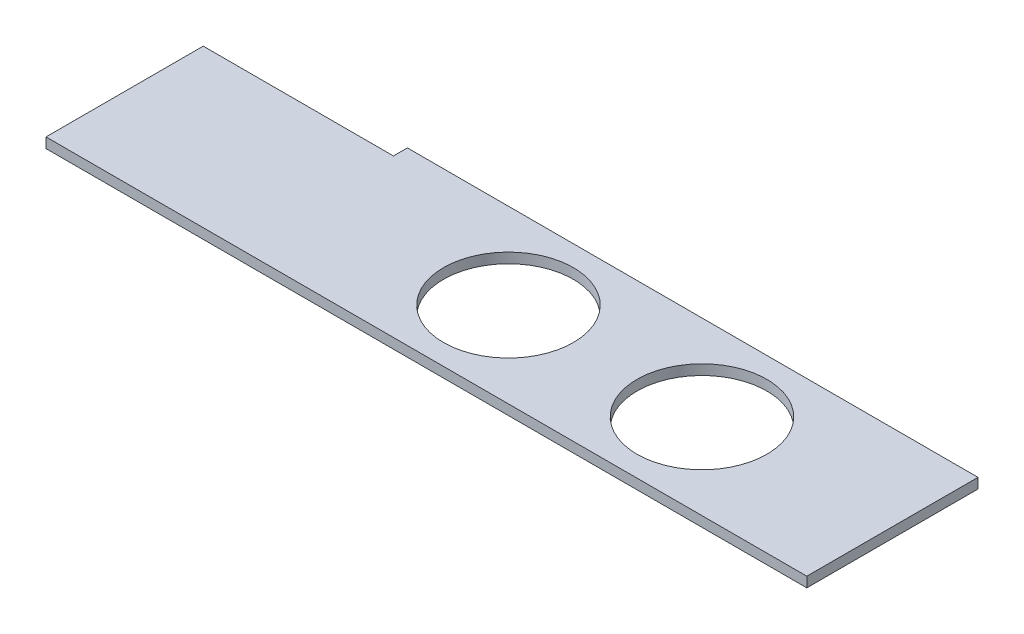
ISO-10303-21;
HEADER;
FILE_DESCRIPTION(('STEP AP214'),'2;1');
FILE_NAME('part.step','',(''),(''),'','','');
FILE_SCHEMA(('AUTOMOTIVE_DESIGN { 1 0 10303 214 1 1 1 1 }'));
ENDSEC;
DATA;
#1=APPLICATION_CONTEXT('core data for automotive mechanical design processes');
#2=APPLICATION_PROTOCOL_DEFINITION('international standard','automotive_design',2000,#1);
#3=PRODUCT_CONTEXT('',#1,'mechanical');
#4=PRODUCT('Part','Part','',(#3));
#5=PRODUCT_RELATED_PRODUCT_CATEGORY('part','',(#4));
#6=PRODUCT_DEFINITION_FORMATION('','',#4);
#7=PRODUCT_DEFINITION_CONTEXT('part definition',#1,'design');
#8=PRODUCT_DEFINITION('design','',#6,#7);
#9=PRODUCT_DEFINITION_SHAPE('','',#8);
#10=(LENGTH_UNIT() NAMED_UNIT(*) SI_UNIT(.MILLI.,.METRE.));
#11=(NAMED_UNIT(*) PLANE_ANGLE_UNIT() SI_UNIT($,.RADIAN.));
#12=(NAMED_UNIT(*) SI_UNIT($,.STERADIAN.) SOLID_ANGLE_UNIT());
#13=UNCERTAINTY_MEASURE_WITH_UNIT(LENGTH_MEASURE(1.E-05),#10,'distance_accuracy_value','');
#14=(GEOMETRIC_REPRESENTATION_CONTEXT(3) GLOBAL_UNCERTAINTY_ASSIGNED_CONTEXT((#13)) GLOBAL_UNIT_ASSIGNED_CONTEXT((#10,
#11,#12)) REPRESENTATION_CONTEXT('',''));
#15=CARTESIAN_POINT('',(0.,0.,0.));
#16=DIRECTION('',(0.,0.,1.));
#17=DIRECTION('',(1.,0.,0.));
#18=AXIS2_PLACEMENT_3D('',#15,#16,#17);
#19=CARTESIAN_POINT('',(0.,8.,0.));
#20=DIRECTION('',(-1.,0.,0.));
#21=DIRECTION('',(0.,0.,1.));
#22=AXIS2_PLACEMENT_3D('',#19,#20,#21);
#23=PLANE('',#22);
#24=DIRECTION('',(0.,1.,0.));
#25=VECTOR('',#24,1.);
#26=CARTESIAN_POINT('',(0.,0.,-124.));
#27=LINE('',#26,#25);
#28=CARTESIAN_POINT('',(0.,0.,-124.));
#29=VERTEX_POINT('',#28);
#30=CARTESIAN_POINT('',(0.,8.,-124.));
#31=VERTEX_POINT('',#30);
#32=EDGE_CURVE('E110',#29,#31,#27,.T.);
#33=ORIENTED_EDGE('',*,*,#32,.F.);
#34=DIRECTION('',(0.,0.,-1.));
#35=VECTOR('',#34,1.);
#36=CARTESIAN_POINT('',(0.,0.,0.));
#37=LINE('',#36,#35);
#38=CARTESIAN_POINT('',(0.,0.,0.));
#39=VERTEX_POINT('',#38);
#40=EDGE_CURVE('E118',#39,#29,#37,.T.);
#41=ORIENTED_EDGE('',*,*,#40,.F.);
#42=DIRECTION('',(0.,-1.,0.));
#43=VECTOR('',#42,1.);
#44=CARTESIAN_POINT('',(0.,8.,0.));
#45=LINE('',#44,#43);
#46=CARTESIAN_POINT('',(0.,8.,0.));
#47=VERTEX_POINT('',#46);
#48=EDGE_CURVE('E11',#47,#39,#45,.T.);
#49=ORIENTED_EDGE('',*,*,#48,.F.);
#50=DIRECTION('',(0.,0.,-1.));
#51=VECTOR('',#50,1.);
#52=CARTESIAN_POINT('',(0.,8.,0.));
#53=LINE('',#52,#51);
#54=EDGE_CURVE('E120',#47,#31,#53,.T.);
#55=ORIENTED_EDGE('',*,*,#54,.T.);
#56=EDGE_LOOP('',(#33,#41,#49,#55));
#57=FACE_BOUND('',#56,.T.);
#58=ADVANCED_FACE('F45',(#57),#23,.T.);
#59=CARTESIAN_POINT('',(0.,8.,0.));
#60=DIRECTION('',(0.,0.,-1.));
#61=DIRECTION('',(-1.,0.,0.));
#62=AXIS2_PLACEMENT_3D('',#59,#60,#61);
#63=PLANE('',#62);
#64=DIRECTION('',(1.,0.,0.));
#65=VECTOR('',#64,1.);
#66=CARTESIAN_POINT('',(0.,0.,0.));
#67=LINE('',#66,#65);
#68=CARTESIAN_POINT('',(600.,0.,0.));
#69=VERTEX_POINT('',#68);
#70=EDGE_CURVE('E125',#39,#69,#67,.T.);
#71=ORIENTED_EDGE('',*,*,#70,.T.);
#72=DIRECTION('',(0.,-1.,0.));
#73=VECTOR('',#72,1.);
#74=CARTESIAN_POINT('',(600.,8.,0.));
#75=LINE('',#74,#73);
#76=CARTESIAN_POINT('',(600.,8.,0.));
#77=VERTEX_POINT('',#76);
#78=EDGE_CURVE('E53',#77,#69,#75,.T.);
#79=ORIENTED_EDGE('',*,*,#78,.F.);
#80=DIRECTION('',(1.,0.,0.));
#81=VECTOR('',#80,1.);
#82=CARTESIAN_POINT('',(0.,8.,0.));
#83=LINE('',#82,#81);
#84=EDGE_CURVE('E157',#47,#77,#83,.T.);
#85=ORIENTED_EDGE('',*,*,#84,.F.);
#86=ORIENTED_EDGE('',*,*,#48,.T.);
#87=EDGE_LOOP('',(#71,#79,#85,#86));
#88=FACE_BOUND('',#87,.T.);
#89=ADVANCED_FACE('F202',(#88),#63,.F.);
#90=CARTESIAN_POINT('',(600.,8.,0.));
#91=DIRECTION('',(-1.,0.,0.));
#92=DIRECTION('',(0.,0.,1.));
#93=AXIS2_PLACEMENT_3D('',#90,#91,#92);
#94=PLANE('',#93);
#95=DIRECTION('',(0.,0.,-1.));
#96=VECTOR('',#95,1.);
#97=CARTESIAN_POINT('',(600.,0.,0.));
#98=LINE('',#97,#96);
#99=CARTESIAN_POINT('',(600.,0.,-135.));
#100=VERTEX_POINT('',#99);
#101=EDGE_CURVE('E85',#69,#100,#98,.T.);
#102=ORIENTED_EDGE('',*,*,#101,.T.);
#103=DIRECTION('',(0.,-1.,0.));
#104=VECTOR('',#103,1.);
#105=CARTESIAN_POINT('',(600.,8.,-135.));
#106=LINE('',#105,#104);
#107=CARTESIAN_POINT('',(600.,8.,-135.));
#108=VERTEX_POINT('',#107);
#109=EDGE_CURVE('E144',#108,#100,#106,.T.);
#110=ORIENTED_EDGE('',*,*,#109,.F.);
#111=DIRECTION('',(0.,0.,-1.));
#112=VECTOR('',#111,1.);
#113=CARTESIAN_POINT('',(600.,8.,0.));
#114=LINE('',#113,#112);
#115=EDGE_CURVE('E69',#77,#108,#114,.T.);
#116=ORIENTED_EDGE('',*,*,#115,.F.);
#117=ORIENTED_EDGE('',*,*,#78,.T.);
#118=EDGE_LOOP('',(#102,#110,#116,#117));
#119=FACE_BOUND('',#118,.T.);
#120=ADVANCED_FACE('F148',(#119),#94,.F.);
#121=CARTESIAN_POINT('',(0.,8.,-135.));
#122=DIRECTION('',(0.,0.,1.));
#123=DIRECTION('',(1.,0.,0.));
#124=AXIS2_PLACEMENT_3D('',#121,#122,#123);
#125=PLANE('',#124);
#126=DIRECTION('',(-1.,0.,0.));
#127=VECTOR('',#126,1.);
#128=CARTESIAN_POINT('',(0.,0.,-135.));
#129=LINE('',#128,#127);
#130=CARTESIAN_POINT('',(150.,0.,-135.));
#131=VERTEX_POINT('',#130);
#132=EDGE_CURVE('E140',#100,#131,#129,.T.);
#133=ORIENTED_EDGE('',*,*,#132,.T.);
#134=DIRECTION('',(0.,1.,0.));
#135=VECTOR('',#134,1.);
#136=CARTESIAN_POINT('',(150.,0.,-135.));
#137=LINE('',#136,#135);
#138=CARTESIAN_POINT('',(150.,8.,-135.));
#139=VERTEX_POINT('',#138);
#140=EDGE_CURVE('E127',#131,#139,#137,.T.);
#141=ORIENTED_EDGE('',*,*,#140,.T.);
#142=DIRECTION('',(-1.,0.,0.));
#143=VECTOR('',#142,1.);
#144=CARTESIAN_POINT('',(0.,8.,-135.));
#145=LINE('',#144,#143);
#146=EDGE_CURVE('E135',#108,#139,#145,.T.);
#147=ORIENTED_EDGE('',*,*,#146,.F.);
#148=ORIENTED_EDGE('',*,*,#109,.T.);
#149=EDGE_LOOP('',(#133,#141,#147,#148));
#150=FACE_BOUND('',#149,.T.);
#151=ADVANCED_FACE('F152',(#150),#125,.F.);
#152=CARTESIAN_POINT('',(0.,8.,0.));
#153=DIRECTION('',(0.,1.,0.));
#154=DIRECTION('',(0.,0.,1.));
#155=AXIS2_PLACEMENT_3D('',#152,#153,#154);
#156=PLANE('',#155);
#157=DIRECTION('',(0.,0.,-1.));
#158=VECTOR('',#157,1.);
#159=CARTESIAN_POINT('',(150.,8.,-135.));
#160=LINE('',#159,#158);
#161=CARTESIAN_POINT('',(150.,8.,-124.));
#162=VERTEX_POINT('',#161);
#163=EDGE_CURVE('E116',#162,#139,#160,.T.);
#164=ORIENTED_EDGE('',*,*,#163,.F.);
#165=DIRECTION('',(1.,0.,0.));
#166=VECTOR('',#165,1.);
#167=CARTESIAN_POINT('',(0.,8.,-124.));
#168=LINE('',#167,#166);
#169=EDGE_CURVE('E178',#31,#162,#168,.T.);
#170=ORIENTED_EDGE('',*,*,#169,.F.);
#171=ORIENTED_EDGE('',*,*,#54,.F.);
#172=ORIENTED_EDGE('',*,*,#84,.T.);
#173=ORIENTED_EDGE('',*,*,#115,.T.);
#174=ORIENTED_EDGE('',*,*,#146,.T.);
#175=EDGE_LOOP('',(#164,#170,#171,#172,#173,#174));
#176=FACE_BOUND('',#175,.T.);
#177=CARTESIAN_POINT('',(449.8,8.,-67.4999999999999));
#178=DIRECTION('',(0.,1.,0.));
#179=DIRECTION('',(0.,0.,1.));
#180=AXIS2_PLACEMENT_3D('',#177,#178,#179);
#181=CIRCLE('',#180,51.2000000000001);
#182=CARTESIAN_POINT('',(449.8,8.,-16.2999999999998));
#183=VERTEX_POINT('',#182);
#184=EDGE_CURVE('E175',#183,#183,#181,.T.);
#185=ORIENTED_EDGE('',*,*,#184,.F.);
#186=EDGE_LOOP('',(#185));
#187=FACE_BOUND('',#186,.T.);
#188=CARTESIAN_POINT('',(297.2,8.,-67.5));
#189=DIRECTION('',(0.,1.,0.));
#190=DIRECTION('',(0.,0.,1.));
#191=AXIS2_PLACEMENT_3D('',#188,#189,#190);
#192=CIRCLE('',#191,51.2000000000001);
#193=CARTESIAN_POINT('',(297.2,8.,-16.2999999999999));
#194=VERTEX_POINT('',#193);
#195=EDGE_CURVE('E167',#194,#194,#192,.T.);
#196=ORIENTED_EDGE('',*,*,#195,.F.);
#197=EDGE_LOOP('',(#196));
#198=FACE_BOUND('',#197,.T.);
#199=ADVANCED_FACE('F187',(#176,#187,#198),#156,.T.);
#200=CARTESIAN_POINT('',(0.,0.,0.));
#201=DIRECTION('',(0.,1.,0.));
#202=DIRECTION('',(0.,0.,1.));
#203=AXIS2_PLACEMENT_3D('',#200,#201,#202);
#204=PLANE('',#203);
#205=CARTESIAN_POINT('',(449.8,0.,-67.4999999999999));
#206=DIRECTION('',(0.,1.,0.));
#207=DIRECTION('',(0.,0.,1.));
#208=AXIS2_PLACEMENT_3D('',#205,#206,#207);
#209=CIRCLE('',#208,51.2000000000001);
#210=CARTESIAN_POINT('',(449.8,0.,-16.2999999999998));
#211=VERTEX_POINT('',#210);
#212=EDGE_CURVE('E171',#211,#211,#209,.T.);
#213=ORIENTED_EDGE('',*,*,#212,.T.);
#214=EDGE_LOOP('',(#213));
#215=FACE_BOUND('',#214,.T.);
#216=CARTESIAN_POINT('',(297.2,0.,-67.5));
#217=DIRECTION('',(0.,1.,0.));
#218=DIRECTION('',(0.,0.,1.));
#219=AXIS2_PLACEMENT_3D('',#216,#217,#218);
#220=CIRCLE('',#219,51.2000000000001);
#221=CARTESIAN_POINT('',(297.2,0.,-16.2999999999999));
#222=VERTEX_POINT('',#221);
#223=EDGE_CURVE('E163',#222,#222,#220,.T.);
#224=ORIENTED_EDGE('',*,*,#223,.T.);
#225=EDGE_LOOP('',(#224));
#226=FACE_BOUND('',#225,.T.);
#227=DIRECTION('',(1.,0.,0.));
#228=VECTOR('',#227,1.);
#229=CARTESIAN_POINT('',(0.,0.,-124.));
#230=LINE('',#229,#228);
#231=CARTESIAN_POINT('',(150.,0.,-124.));
#232=VERTEX_POINT('',#231);
#233=EDGE_CURVE('E106',#29,#232,#230,.T.);
#234=ORIENTED_EDGE('',*,*,#233,.T.);
#235=DIRECTION('',(0.,0.,-1.));
#236=VECTOR('',#235,1.);
#237=CARTESIAN_POINT('',(150.,0.,-135.));
#238=LINE('',#237,#236);
#239=EDGE_CURVE('E60',#232,#131,#238,.T.);
#240=ORIENTED_EDGE('',*,*,#239,.T.);
#241=ORIENTED_EDGE('',*,*,#132,.F.);
#242=ORIENTED_EDGE('',*,*,#101,.F.);
#243=ORIENTED_EDGE('',*,*,#70,.F.);
#244=ORIENTED_EDGE('',*,*,#40,.T.);
#245=EDGE_LOOP('',(#234,#240,#241,#242,#243,#244));
#246=FACE_BOUND('',#245,.T.);
#247=ADVANCED_FACE('F124',(#215,#226,#246),#204,.F.);
#248=CARTESIAN_POINT('',(297.2,0.,-67.5));
#249=DIRECTION('',(0.,1.,0.));
#250=DIRECTION('',(0.,0.,1.));
#251=AXIS2_PLACEMENT_3D('',#248,#249,#250);
#252=CYLINDRICAL_SURFACE('',#251,51.2000000000001);
#253=ORIENTED_EDGE('',*,*,#223,.F.);
#254=EDGE_LOOP('',(#253));
#255=FACE_BOUND('',#254,.T.);
#256=ORIENTED_EDGE('',*,*,#195,.T.);
#257=EDGE_LOOP('',(#256));
#258=FACE_BOUND('',#257,.T.);
#259=ADVANCED_FACE('F198',(#255,#258),#252,.F.);
#260=CARTESIAN_POINT('',(449.8,0.,-67.4999999999999));
#261=DIRECTION('',(0.,1.,0.));
#262=DIRECTION('',(0.,0.,1.));
#263=AXIS2_PLACEMENT_3D('',#260,#261,#262);
#264=CYLINDRICAL_SURFACE('',#263,51.2000000000001);
#265=ORIENTED_EDGE('',*,*,#212,.F.);
#266=EDGE_LOOP('',(#265));
#267=FACE_BOUND('',#266,.T.);
#268=ORIENTED_EDGE('',*,*,#184,.T.);
#269=EDGE_LOOP('',(#268));
#270=FACE_BOUND('',#269,.T.);
#271=ADVANCED_FACE('F191',(#267,#270),#264,.F.);
#272=CARTESIAN_POINT('',(150.,0.,-135.));
#273=DIRECTION('',(1.,0.,0.));
#274=DIRECTION('',(0.,0.,-1.));
#275=AXIS2_PLACEMENT_3D('',#272,#273,#274);
#276=PLANE('',#275);
#277=ORIENTED_EDGE('',*,*,#163,.T.);
#278=ORIENTED_EDGE('',*,*,#140,.F.);
#279=ORIENTED_EDGE('',*,*,#239,.F.);
#280=DIRECTION('',(0.,1.,0.));
#281=VECTOR('',#280,1.);
#282=CARTESIAN_POINT('',(150.,0.,-124.));
#283=LINE('',#282,#281);
#284=EDGE_CURVE('E112',#232,#162,#283,.T.);
#285=ORIENTED_EDGE('',*,*,#284,.T.);
#286=EDGE_LOOP('',(#277,#278,#279,#285));
#287=FACE_BOUND('',#286,.T.);
#288=ADVANCED_FACE('F189',(#287),#276,.F.);
#289=CARTESIAN_POINT('',(0.,0.,-124.));
#290=DIRECTION('',(0.,0.,1.));
#291=DIRECTION('',(1.,0.,0.));
#292=AXIS2_PLACEMENT_3D('',#289,#290,#291);
#293=PLANE('',#292);
#294=ORIENTED_EDGE('',*,*,#169,.T.);
#295=ORIENTED_EDGE('',*,*,#284,.F.);
#296=ORIENTED_EDGE('',*,*,#233,.F.);
#297=ORIENTED_EDGE('',*,*,#32,.T.);
#298=EDGE_LOOP('',(#294,#295,#296,#297));
#299=FACE_BOUND('',#298,.T.);
#300=ADVANCED_FACE('F109',(#299),#293,.F.);
#301=CLOSED_SHELL('',(#58,#89,#120,#151,#199,#247,#259,#271,#288,#300));
#302=MANIFOLD_SOLID_BREP('B2',#301);
#303=ADVANCED_BREP_SHAPE_REPRESENTATION('',(#18,#302),#14);
#304=SHAPE_DEFINITION_REPRESENTATION(#9,#303);
ENDSEC;
END-ISO-10303-21;
